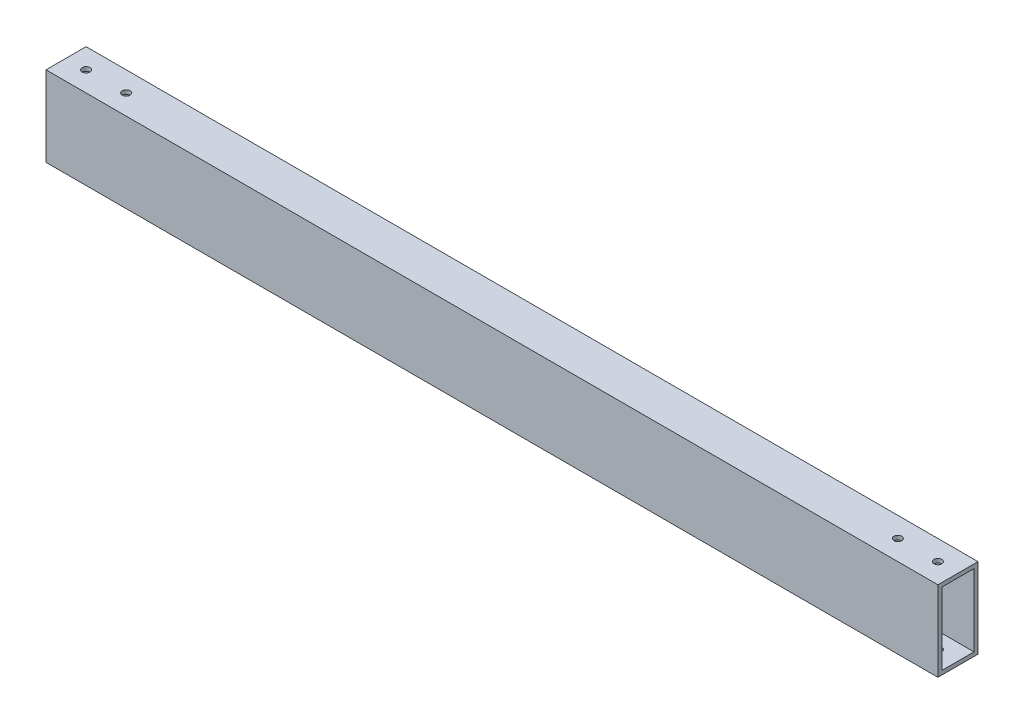
ISO-10303-21;
HEADER;
FILE_DESCRIPTION(('STEP AP214'),'2;1');
FILE_NAME('part.step','',(''),(''),'','','');
FILE_SCHEMA(('AUTOMOTIVE_DESIGN { 1 0 10303 214 1 1 1 1 }'));
ENDSEC;
DATA;
#1=APPLICATION_CONTEXT('core data for automotive mechanical design processes');
#2=APPLICATION_PROTOCOL_DEFINITION('international standard','automotive_design',2000,#1);
#3=PRODUCT_CONTEXT('',#1,'mechanical');
#4=PRODUCT('Part','Part','',(#3));
#5=PRODUCT_RELATED_PRODUCT_CATEGORY('part','',(#4));
#6=PRODUCT_DEFINITION_FORMATION('','',#4);
#7=PRODUCT_DEFINITION_CONTEXT('part definition',#1,'design');
#8=PRODUCT_DEFINITION('design','',#6,#7);
#9=PRODUCT_DEFINITION_SHAPE('','',#8);
#10=(LENGTH_UNIT() NAMED_UNIT(*) SI_UNIT(.MILLI.,.METRE.));
#11=(NAMED_UNIT(*) PLANE_ANGLE_UNIT() SI_UNIT($,.RADIAN.));
#12=(NAMED_UNIT(*) SI_UNIT($,.STERADIAN.) SOLID_ANGLE_UNIT());
#13=UNCERTAINTY_MEASURE_WITH_UNIT(LENGTH_MEASURE(1.E-05),#10,'distance_accuracy_value','');
#14=(GEOMETRIC_REPRESENTATION_CONTEXT(3) GLOBAL_UNCERTAINTY_ASSIGNED_CONTEXT((#13)) GLOBAL_UNIT_ASSIGNED_CONTEXT((#10,
#11,#12)) REPRESENTATION_CONTEXT('',''));
#15=CARTESIAN_POINT('',(0.,0.,0.));
#16=DIRECTION('',(0.,0.,1.));
#17=DIRECTION('',(1.,0.,0.));
#18=AXIS2_PLACEMENT_3D('',#15,#16,#17);
#19=CARTESIAN_POINT('',(282.575,0.,0.));
#20=DIRECTION('',(1.,0.,0.));
#21=DIRECTION('',(0.,0.,-1.));
#22=AXIS2_PLACEMENT_3D('',#19,#20,#21);
#23=PLANE('',#22);
#24=DIRECTION('',(0.,1.,0.));
#25=VECTOR('',#24,1.);
#26=CARTESIAN_POINT('',(282.575,-25.4,-12.7));
#27=LINE('',#26,#25);
#28=CARTESIAN_POINT('',(282.575,-25.4,-12.7));
#29=VERTEX_POINT('',#28);
#30=CARTESIAN_POINT('',(282.575,25.4,-12.7));
#31=VERTEX_POINT('',#30);
#32=EDGE_CURVE('E162',#29,#31,#27,.T.);
#33=ORIENTED_EDGE('',*,*,#32,.T.);
#34=DIRECTION('',(0.,0.,1.));
#35=VECTOR('',#34,1.);
#36=CARTESIAN_POINT('',(282.575,25.4,12.7));
#37=LINE('',#36,#35);
#38=CARTESIAN_POINT('',(282.575,25.4,12.7));
#39=VERTEX_POINT('',#38);
#40=EDGE_CURVE('E165',#31,#39,#37,.T.);
#41=ORIENTED_EDGE('',*,*,#40,.T.);
#42=DIRECTION('',(0.,-1.,0.));
#43=VECTOR('',#42,1.);
#44=CARTESIAN_POINT('',(282.575,-25.4,12.7));
#45=LINE('',#44,#43);
#46=CARTESIAN_POINT('',(282.575,-25.4,12.7));
#47=VERTEX_POINT('',#46);
#48=EDGE_CURVE('E168',#39,#47,#45,.T.);
#49=ORIENTED_EDGE('',*,*,#48,.T.);
#50=DIRECTION('',(0.,0.,-1.));
#51=VECTOR('',#50,1.);
#52=CARTESIAN_POINT('',(282.575,-25.4,12.7));
#53=LINE('',#52,#51);
#54=EDGE_CURVE('E170',#47,#29,#53,.T.);
#55=ORIENTED_EDGE('',*,*,#54,.T.);
#56=EDGE_LOOP('',(#33,#41,#49,#55));
#57=FACE_BOUND('',#56,.T.);
#58=DIRECTION('',(0.,0.,1.));
#59=VECTOR('',#58,1.);
#60=CARTESIAN_POINT('',(282.575,22.86,0.));
#61=LINE('',#60,#59);
#62=CARTESIAN_POINT('',(282.575,22.86,-10.16));
#63=VERTEX_POINT('',#62);
#64=CARTESIAN_POINT('',(282.575,22.86,10.16));
#65=VERTEX_POINT('',#64);
#66=EDGE_CURVE('E132',#63,#65,#61,.T.);
#67=ORIENTED_EDGE('',*,*,#66,.F.);
#68=DIRECTION('',(0.,1.,0.));
#69=VECTOR('',#68,1.);
#70=CARTESIAN_POINT('',(282.575,0.,-10.16));
#71=LINE('',#70,#69);
#72=CARTESIAN_POINT('',(282.575,-22.86,-10.16));
#73=VERTEX_POINT('',#72);
#74=EDGE_CURVE('E124',#73,#63,#71,.T.);
#75=ORIENTED_EDGE('',*,*,#74,.F.);
#76=DIRECTION('',(0.,0.,-1.));
#77=VECTOR('',#76,1.);
#78=CARTESIAN_POINT('',(282.575,-22.86,0.));
#79=LINE('',#78,#77);
#80=CARTESIAN_POINT('',(282.575,-22.86,10.16));
#81=VERTEX_POINT('',#80);
#82=EDGE_CURVE('E146',#81,#73,#79,.T.);
#83=ORIENTED_EDGE('',*,*,#82,.F.);
#84=DIRECTION('',(0.,-1.,0.));
#85=VECTOR('',#84,1.);
#86=CARTESIAN_POINT('',(282.575,0.,10.16));
#87=LINE('',#86,#85);
#88=EDGE_CURVE('E144',#65,#81,#87,.T.);
#89=ORIENTED_EDGE('',*,*,#88,.F.);
#90=EDGE_LOOP('',(#67,#75,#83,#89));
#91=FACE_BOUND('',#90,.T.);
#92=ADVANCED_FACE('F57',(#57,#91),#23,.T.);
#93=CARTESIAN_POINT('',(-282.575,0.,0.));
#94=DIRECTION('',(1.,0.,0.));
#95=DIRECTION('',(0.,0.,-1.));
#96=AXIS2_PLACEMENT_3D('',#93,#94,#95);
#97=PLANE('',#96);
#98=DIRECTION('',(0.,1.,0.));
#99=VECTOR('',#98,1.);
#100=CARTESIAN_POINT('',(-282.575,-25.4,-12.7));
#101=LINE('',#100,#99);
#102=CARTESIAN_POINT('',(-282.575,-25.4,-12.7));
#103=VERTEX_POINT('',#102);
#104=CARTESIAN_POINT('',(-282.575,25.4,-12.7));
#105=VERTEX_POINT('',#104);
#106=EDGE_CURVE('E140',#103,#105,#101,.T.);
#107=ORIENTED_EDGE('',*,*,#106,.F.);
#108=DIRECTION('',(0.,0.,-1.));
#109=VECTOR('',#108,1.);
#110=CARTESIAN_POINT('',(-282.575,-25.4,12.7));
#111=LINE('',#110,#109);
#112=CARTESIAN_POINT('',(-282.575,-25.4,12.7));
#113=VERTEX_POINT('',#112);
#114=EDGE_CURVE('E166',#113,#103,#111,.T.);
#115=ORIENTED_EDGE('',*,*,#114,.F.);
#116=DIRECTION('',(0.,-1.,0.));
#117=VECTOR('',#116,1.);
#118=CARTESIAN_POINT('',(-282.575,-25.4,12.7));
#119=LINE('',#118,#117);
#120=CARTESIAN_POINT('',(-282.575,25.4,12.7));
#121=VERTEX_POINT('',#120);
#122=EDGE_CURVE('E177',#121,#113,#119,.T.);
#123=ORIENTED_EDGE('',*,*,#122,.F.);
#124=DIRECTION('',(0.,0.,1.));
#125=VECTOR('',#124,1.);
#126=CARTESIAN_POINT('',(-282.575,25.4,12.7));
#127=LINE('',#126,#125);
#128=EDGE_CURVE('E175',#105,#121,#127,.T.);
#129=ORIENTED_EDGE('',*,*,#128,.F.);
#130=EDGE_LOOP('',(#107,#115,#123,#129));
#131=FACE_BOUND('',#130,.T.);
#132=DIRECTION('',(0.,1.,0.));
#133=VECTOR('',#132,1.);
#134=CARTESIAN_POINT('',(-282.575,0.,-10.16));
#135=LINE('',#134,#133);
#136=CARTESIAN_POINT('',(-282.575,-22.86,-10.16));
#137=VERTEX_POINT('',#136);
#138=CARTESIAN_POINT('',(-282.575,22.86,-10.16));
#139=VERTEX_POINT('',#138);
#140=EDGE_CURVE('E82',#137,#139,#135,.T.);
#141=ORIENTED_EDGE('',*,*,#140,.T.);
#142=DIRECTION('',(0.,0.,1.));
#143=VECTOR('',#142,1.);
#144=CARTESIAN_POINT('',(-282.575,22.86,0.));
#145=LINE('',#144,#143);
#146=CARTESIAN_POINT('',(-282.575,22.86,10.16));
#147=VERTEX_POINT('',#146);
#148=EDGE_CURVE('E139',#139,#147,#145,.T.);
#149=ORIENTED_EDGE('',*,*,#148,.T.);
#150=DIRECTION('',(0.,-1.,0.));
#151=VECTOR('',#150,1.);
#152=CARTESIAN_POINT('',(-282.575,0.,10.16));
#153=LINE('',#152,#151);
#154=CARTESIAN_POINT('',(-282.575,-22.86,10.16));
#155=VERTEX_POINT('',#154);
#156=EDGE_CURVE('E154',#147,#155,#153,.T.);
#157=ORIENTED_EDGE('',*,*,#156,.T.);
#158=DIRECTION('',(0.,0.,-1.));
#159=VECTOR('',#158,1.);
#160=CARTESIAN_POINT('',(-282.575,-22.86,0.));
#161=LINE('',#160,#159);
#162=EDGE_CURVE('E133',#155,#137,#161,.T.);
#163=ORIENTED_EDGE('',*,*,#162,.T.);
#164=EDGE_LOOP('',(#141,#149,#157,#163));
#165=FACE_BOUND('',#164,.T.);
#166=ADVANCED_FACE('F229',(#131,#165),#97,.F.);
#167=CARTESIAN_POINT('',(282.575,-25.4,-12.7));
#168=DIRECTION('',(0.,0.,1.));
#169=DIRECTION('',(1.,0.,0.));
#170=AXIS2_PLACEMENT_3D('',#167,#168,#169);
#171=PLANE('',#170);
#172=ORIENTED_EDGE('',*,*,#106,.T.);
#173=DIRECTION('',(-1.,0.,0.));
#174=VECTOR('',#173,1.);
#175=CARTESIAN_POINT('',(282.575,25.4,-12.7));
#176=LINE('',#175,#174);
#177=EDGE_CURVE('E12',#31,#105,#176,.T.);
#178=ORIENTED_EDGE('',*,*,#177,.F.);
#179=ORIENTED_EDGE('',*,*,#32,.F.);
#180=DIRECTION('',(-1.,0.,0.));
#181=VECTOR('',#180,1.);
#182=CARTESIAN_POINT('',(282.575,-25.4,-12.7));
#183=LINE('',#182,#181);
#184=EDGE_CURVE('E172',#29,#103,#183,.T.);
#185=ORIENTED_EDGE('',*,*,#184,.T.);
#186=EDGE_LOOP('',(#172,#178,#179,#185));
#187=FACE_BOUND('',#186,.T.);
#188=ADVANCED_FACE('F59',(#187),#171,.F.);
#189=CARTESIAN_POINT('',(282.575,25.4,12.7));
#190=DIRECTION('',(0.,-1.,0.));
#191=DIRECTION('',(0.,0.,-1.));
#192=AXIS2_PLACEMENT_3D('',#189,#190,#191);
#193=PLANE('',#192);
#194=CARTESIAN_POINT('',(-269.875,25.4,0.));
#195=DIRECTION('',(0.,1.,0.));
#196=DIRECTION('',(0.,0.,1.));
#197=AXIS2_PLACEMENT_3D('',#194,#195,#196);
#198=CIRCLE('',#197,2.47650000000003);
#199=CARTESIAN_POINT('',(-269.875,25.4,2.47650000000006));
#200=VERTEX_POINT('',#199);
#201=EDGE_CURVE('E265',#200,#200,#198,.T.);
#202=ORIENTED_EDGE('',*,*,#201,.F.);
#203=EDGE_LOOP('',(#202));
#204=FACE_BOUND('',#203,.T.);
#205=CARTESIAN_POINT('',(244.475,25.4,2.08166817117217E-13));
#206=DIRECTION('',(0.,1.,0.));
#207=DIRECTION('',(0.,0.,1.));
#208=AXIS2_PLACEMENT_3D('',#205,#206,#207);
#209=CIRCLE('',#208,2.47649999999997);
#210=CARTESIAN_POINT('',(244.475,25.4,2.47650000000018));
#211=VERTEX_POINT('',#210);
#212=EDGE_CURVE('E269',#211,#211,#209,.T.);
#213=ORIENTED_EDGE('',*,*,#212,.F.);
#214=EDGE_LOOP('',(#213));
#215=FACE_BOUND('',#214,.T.);
#216=CARTESIAN_POINT('',(269.875,25.4,2.08166817117217E-13));
#217=DIRECTION('',(0.,1.,0.));
#218=DIRECTION('',(0.,0.,1.));
#219=AXIS2_PLACEMENT_3D('',#216,#217,#218);
#220=CIRCLE('',#219,2.47650000000003);
#221=CARTESIAN_POINT('',(269.875,25.4,2.47650000000024));
#222=VERTEX_POINT('',#221);
#223=EDGE_CURVE('E273',#222,#222,#220,.T.);
#224=ORIENTED_EDGE('',*,*,#223,.F.);
#225=EDGE_LOOP('',(#224));
#226=FACE_BOUND('',#225,.T.);
#227=CARTESIAN_POINT('',(-244.475,25.4,0.));
#228=DIRECTION('',(0.,1.,0.));
#229=DIRECTION('',(0.,0.,1.));
#230=AXIS2_PLACEMENT_3D('',#227,#228,#229);
#231=CIRCLE('',#230,2.4765);
#232=CARTESIAN_POINT('',(-244.475,25.4,2.47650000000003));
#233=VERTEX_POINT('',#232);
#234=EDGE_CURVE('E277',#233,#233,#231,.T.);
#235=ORIENTED_EDGE('',*,*,#234,.F.);
#236=EDGE_LOOP('',(#235));
#237=FACE_BOUND('',#236,.T.);
#238=ORIENTED_EDGE('',*,*,#128,.T.);
#239=DIRECTION('',(-1.,0.,0.));
#240=VECTOR('',#239,1.);
#241=CARTESIAN_POINT('',(282.575,25.4,12.7));
#242=LINE('',#241,#240);
#243=EDGE_CURVE('E66',#39,#121,#242,.T.);
#244=ORIENTED_EDGE('',*,*,#243,.F.);
#245=ORIENTED_EDGE('',*,*,#40,.F.);
#246=ORIENTED_EDGE('',*,*,#177,.T.);
#247=EDGE_LOOP('',(#238,#244,#245,#246));
#248=FACE_BOUND('',#247,.T.);
#249=ADVANCED_FACE('F254',(#204,#215,#226,#237,#248),#193,.F.);
#250=CARTESIAN_POINT('',(282.575,-25.4,12.7));
#251=DIRECTION('',(0.,0.,-1.));
#252=DIRECTION('',(-1.,0.,0.));
#253=AXIS2_PLACEMENT_3D('',#250,#251,#252);
#254=PLANE('',#253);
#255=ORIENTED_EDGE('',*,*,#122,.T.);
#256=DIRECTION('',(-1.,0.,0.));
#257=VECTOR('',#256,1.);
#258=CARTESIAN_POINT('',(282.575,-25.4,12.7));
#259=LINE('',#258,#257);
#260=EDGE_CURVE('E182',#47,#113,#259,.T.);
#261=ORIENTED_EDGE('',*,*,#260,.F.);
#262=ORIENTED_EDGE('',*,*,#48,.F.);
#263=ORIENTED_EDGE('',*,*,#243,.T.);
#264=EDGE_LOOP('',(#255,#261,#262,#263));
#265=FACE_BOUND('',#264,.T.);
#266=ADVANCED_FACE('F251',(#265),#254,.F.);
#267=CARTESIAN_POINT('',(282.575,-25.4,12.7));
#268=DIRECTION('',(0.,1.,0.));
#269=DIRECTION('',(0.,0.,1.));
#270=AXIS2_PLACEMENT_3D('',#267,#268,#269);
#271=PLANE('',#270);
#272=CARTESIAN_POINT('',(-269.875,-25.4,0.));
#273=DIRECTION('',(0.,1.,0.));
#274=DIRECTION('',(0.,0.,1.));
#275=AXIS2_PLACEMENT_3D('',#272,#273,#274);
#276=CIRCLE('',#275,2.47650000000003);
#277=CARTESIAN_POINT('',(-269.875,-25.4,2.47650000000006));
#278=VERTEX_POINT('',#277);
#279=EDGE_CURVE('E191',#278,#278,#276,.T.);
#280=ORIENTED_EDGE('',*,*,#279,.T.);
#281=EDGE_LOOP('',(#280));
#282=FACE_BOUND('',#281,.T.);
#283=CARTESIAN_POINT('',(244.475,-25.4,2.08166817117217E-13));
#284=DIRECTION('',(0.,1.,0.));
#285=DIRECTION('',(0.,0.,1.));
#286=AXIS2_PLACEMENT_3D('',#283,#284,#285);
#287=CIRCLE('',#286,2.47649999999997);
#288=CARTESIAN_POINT('',(244.475,-25.4,2.47650000000018));
#289=VERTEX_POINT('',#288);
#290=EDGE_CURVE('E298',#289,#289,#287,.T.);
#291=ORIENTED_EDGE('',*,*,#290,.T.);
#292=EDGE_LOOP('',(#291));
#293=FACE_BOUND('',#292,.T.);
#294=CARTESIAN_POINT('',(269.875,-25.4,2.08166817117217E-13));
#295=DIRECTION('',(0.,1.,0.));
#296=DIRECTION('',(0.,0.,1.));
#297=AXIS2_PLACEMENT_3D('',#294,#295,#296);
#298=CIRCLE('',#297,2.47650000000003);
#299=CARTESIAN_POINT('',(269.875,-25.4,2.47650000000024));
#300=VERTEX_POINT('',#299);
#301=EDGE_CURVE('E291',#300,#300,#298,.T.);
#302=ORIENTED_EDGE('',*,*,#301,.T.);
#303=EDGE_LOOP('',(#302));
#304=FACE_BOUND('',#303,.T.);
#305=CARTESIAN_POINT('',(-244.475,-25.4,0.));
#306=DIRECTION('',(0.,1.,0.));
#307=DIRECTION('',(0.,0.,1.));
#308=AXIS2_PLACEMENT_3D('',#305,#306,#307);
#309=CIRCLE('',#308,2.4765);
#310=CARTESIAN_POINT('',(-244.475,-25.4,2.47650000000003));
#311=VERTEX_POINT('',#310);
#312=EDGE_CURVE('E290',#311,#311,#309,.T.);
#313=ORIENTED_EDGE('',*,*,#312,.T.);
#314=EDGE_LOOP('',(#313));
#315=FACE_BOUND('',#314,.T.);
#316=ORIENTED_EDGE('',*,*,#114,.T.);
#317=ORIENTED_EDGE('',*,*,#184,.F.);
#318=ORIENTED_EDGE('',*,*,#54,.F.);
#319=ORIENTED_EDGE('',*,*,#260,.T.);
#320=EDGE_LOOP('',(#316,#317,#318,#319));
#321=FACE_BOUND('',#320,.T.);
#322=ADVANCED_FACE('F248',(#282,#293,#304,#315,#321),#271,.F.);
#323=CARTESIAN_POINT('',(282.575,0.,-10.16));
#324=DIRECTION('',(0.,0.,1.));
#325=DIRECTION('',(1.,0.,0.));
#326=AXIS2_PLACEMENT_3D('',#323,#324,#325);
#327=PLANE('',#326);
#328=ORIENTED_EDGE('',*,*,#140,.F.);
#329=DIRECTION('',(-1.,0.,0.));
#330=VECTOR('',#329,1.);
#331=CARTESIAN_POINT('',(282.575,-22.86,-10.16));
#332=LINE('',#331,#330);
#333=EDGE_CURVE('E128',#73,#137,#332,.T.);
#334=ORIENTED_EDGE('',*,*,#333,.F.);
#335=ORIENTED_EDGE('',*,*,#74,.T.);
#336=DIRECTION('',(-1.,0.,0.));
#337=VECTOR('',#336,1.);
#338=CARTESIAN_POINT('',(282.575,22.86,-10.16));
#339=LINE('',#338,#337);
#340=EDGE_CURVE('E127',#63,#139,#339,.T.);
#341=ORIENTED_EDGE('',*,*,#340,.T.);
#342=EDGE_LOOP('',(#328,#334,#335,#341));
#343=FACE_BOUND('',#342,.T.);
#344=ADVANCED_FACE('F126',(#343),#327,.T.);
#345=CARTESIAN_POINT('',(282.575,22.86,0.));
#346=DIRECTION('',(0.,-1.,0.));
#347=DIRECTION('',(0.,0.,-1.));
#348=AXIS2_PLACEMENT_3D('',#345,#346,#347);
#349=PLANE('',#348);
#350=CARTESIAN_POINT('',(-269.875,22.86,0.));
#351=DIRECTION('',(0.,-1.,0.));
#352=DIRECTION('',(0.,0.,-1.));
#353=AXIS2_PLACEMENT_3D('',#350,#351,#352);
#354=CIRCLE('',#353,2.47650000000003);
#355=CARTESIAN_POINT('',(-269.875,22.86,-2.47650000000001));
#356=VERTEX_POINT('',#355);
#357=EDGE_CURVE('E152',#356,#356,#354,.T.);
#358=ORIENTED_EDGE('',*,*,#357,.F.);
#359=EDGE_LOOP('',(#358));
#360=FACE_BOUND('',#359,.T.);
#361=CARTESIAN_POINT('',(244.475,22.86,2.08166817117217E-13));
#362=DIRECTION('',(0.,-1.,0.));
#363=DIRECTION('',(0.,0.,-1.));
#364=AXIS2_PLACEMENT_3D('',#361,#362,#363);
#365=CIRCLE('',#364,2.47649999999997);
#366=CARTESIAN_POINT('',(244.475,22.86,-2.47649999999976));
#367=VERTEX_POINT('',#366);
#368=EDGE_CURVE('E197',#367,#367,#365,.T.);
#369=ORIENTED_EDGE('',*,*,#368,.F.);
#370=EDGE_LOOP('',(#369));
#371=FACE_BOUND('',#370,.T.);
#372=CARTESIAN_POINT('',(269.875,22.86,2.08166817117217E-13));
#373=DIRECTION('',(0.,-1.,0.));
#374=DIRECTION('',(0.,0.,-1.));
#375=AXIS2_PLACEMENT_3D('',#372,#373,#374);
#376=CIRCLE('',#375,2.47650000000003);
#377=CARTESIAN_POINT('',(269.875,22.86,-2.47649999999982));
#378=VERTEX_POINT('',#377);
#379=EDGE_CURVE('E194',#378,#378,#376,.T.);
#380=ORIENTED_EDGE('',*,*,#379,.F.);
#381=EDGE_LOOP('',(#380));
#382=FACE_BOUND('',#381,.T.);
#383=CARTESIAN_POINT('',(-244.475,22.86,0.));
#384=DIRECTION('',(0.,-1.,0.));
#385=DIRECTION('',(0.,0.,-1.));
#386=AXIS2_PLACEMENT_3D('',#383,#384,#385);
#387=CIRCLE('',#386,2.4765);
#388=CARTESIAN_POINT('',(-244.475,22.86,-2.47649999999997));
#389=VERTEX_POINT('',#388);
#390=EDGE_CURVE('E190',#389,#389,#387,.T.);
#391=ORIENTED_EDGE('',*,*,#390,.F.);
#392=EDGE_LOOP('',(#391));
#393=FACE_BOUND('',#392,.T.);
#394=ORIENTED_EDGE('',*,*,#148,.F.);
#395=ORIENTED_EDGE('',*,*,#340,.F.);
#396=ORIENTED_EDGE('',*,*,#66,.T.);
#397=DIRECTION('',(-1.,0.,0.));
#398=VECTOR('',#397,1.);
#399=CARTESIAN_POINT('',(282.575,22.86,10.16));
#400=LINE('',#399,#398);
#401=EDGE_CURVE('E141',#65,#147,#400,.T.);
#402=ORIENTED_EDGE('',*,*,#401,.T.);
#403=EDGE_LOOP('',(#394,#395,#396,#402));
#404=FACE_BOUND('',#403,.T.);
#405=ADVANCED_FACE('F136',(#360,#371,#382,#393,#404),#349,.T.);
#406=CARTESIAN_POINT('',(282.575,0.,10.16));
#407=DIRECTION('',(0.,0.,-1.));
#408=DIRECTION('',(-1.,0.,0.));
#409=AXIS2_PLACEMENT_3D('',#406,#407,#408);
#410=PLANE('',#409);
#411=ORIENTED_EDGE('',*,*,#156,.F.);
#412=ORIENTED_EDGE('',*,*,#401,.F.);
#413=ORIENTED_EDGE('',*,*,#88,.T.);
#414=DIRECTION('',(-1.,0.,0.));
#415=VECTOR('',#414,1.);
#416=CARTESIAN_POINT('',(282.575,-22.86,10.16));
#417=LINE('',#416,#415);
#418=EDGE_CURVE('E74',#81,#155,#417,.T.);
#419=ORIENTED_EDGE('',*,*,#418,.T.);
#420=EDGE_LOOP('',(#411,#412,#413,#419));
#421=FACE_BOUND('',#420,.T.);
#422=ADVANCED_FACE('F221',(#421),#410,.T.);
#423=CARTESIAN_POINT('',(282.575,-22.86,0.));
#424=DIRECTION('',(0.,1.,0.));
#425=DIRECTION('',(0.,0.,1.));
#426=AXIS2_PLACEMENT_3D('',#423,#424,#425);
#427=PLANE('',#426);
#428=CARTESIAN_POINT('',(-269.875,-22.86,0.));
#429=DIRECTION('',(0.,1.,0.));
#430=DIRECTION('',(0.,0.,1.));
#431=AXIS2_PLACEMENT_3D('',#428,#429,#430);
#432=CIRCLE('',#431,2.47650000000003);
#433=CARTESIAN_POINT('',(-269.875,-22.86,2.47650000000006));
#434=VERTEX_POINT('',#433);
#435=EDGE_CURVE('E61',#434,#434,#432,.T.);
#436=ORIENTED_EDGE('',*,*,#435,.F.);
#437=EDGE_LOOP('',(#436));
#438=FACE_BOUND('',#437,.T.);
#439=CARTESIAN_POINT('',(244.475,-22.86,2.08166817117217E-13));
#440=DIRECTION('',(0.,1.,0.));
#441=DIRECTION('',(0.,0.,1.));
#442=AXIS2_PLACEMENT_3D('',#439,#440,#441);
#443=CIRCLE('',#442,2.47649999999997);
#444=CARTESIAN_POINT('',(244.475,-22.86,2.47650000000018));
#445=VERTEX_POINT('',#444);
#446=EDGE_CURVE('E195',#445,#445,#443,.T.);
#447=ORIENTED_EDGE('',*,*,#446,.F.);
#448=EDGE_LOOP('',(#447));
#449=FACE_BOUND('',#448,.T.);
#450=CARTESIAN_POINT('',(269.875,-22.86,2.08166817117217E-13));
#451=DIRECTION('',(0.,1.,0.));
#452=DIRECTION('',(0.,0.,1.));
#453=AXIS2_PLACEMENT_3D('',#450,#451,#452);
#454=CIRCLE('',#453,2.47650000000003);
#455=CARTESIAN_POINT('',(269.875,-22.86,2.47650000000024));
#456=VERTEX_POINT('',#455);
#457=EDGE_CURVE('E192',#456,#456,#454,.T.);
#458=ORIENTED_EDGE('',*,*,#457,.F.);
#459=EDGE_LOOP('',(#458));
#460=FACE_BOUND('',#459,.T.);
#461=CARTESIAN_POINT('',(-244.475,-22.86,0.));
#462=DIRECTION('',(0.,1.,0.));
#463=DIRECTION('',(0.,0.,1.));
#464=AXIS2_PLACEMENT_3D('',#461,#462,#463);
#465=CIRCLE('',#464,2.4765);
#466=CARTESIAN_POINT('',(-244.475,-22.86,2.47650000000003));
#467=VERTEX_POINT('',#466);
#468=EDGE_CURVE('E187',#467,#467,#465,.T.);
#469=ORIENTED_EDGE('',*,*,#468,.F.);
#470=EDGE_LOOP('',(#469));
#471=FACE_BOUND('',#470,.T.);
#472=ORIENTED_EDGE('',*,*,#162,.F.);
#473=ORIENTED_EDGE('',*,*,#418,.F.);
#474=ORIENTED_EDGE('',*,*,#82,.T.);
#475=ORIENTED_EDGE('',*,*,#333,.T.);
#476=EDGE_LOOP('',(#472,#473,#474,#475));
#477=FACE_BOUND('',#476,.T.);
#478=ADVANCED_FACE('F217',(#438,#449,#460,#471,#477),#427,.T.);
#479=CARTESIAN_POINT('',(-244.475,-25.4,0.));
#480=DIRECTION('',(0.,1.,0.));
#481=DIRECTION('',(0.,0.,1.));
#482=AXIS2_PLACEMENT_3D('',#479,#480,#481);
#483=CYLINDRICAL_SURFACE('',#482,2.4765);
#484=ORIENTED_EDGE('',*,*,#468,.T.);
#485=EDGE_LOOP('',(#484));
#486=FACE_BOUND('',#485,.T.);
#487=ORIENTED_EDGE('',*,*,#312,.F.);
#488=EDGE_LOOP('',(#487));
#489=FACE_BOUND('',#488,.T.);
#490=ADVANCED_FACE('F220',(#486,#489),#483,.F.);
#491=CARTESIAN_POINT('',(269.875,-25.4,2.08166817117217E-13));
#492=DIRECTION('',(0.,1.,0.));
#493=DIRECTION('',(0.,0.,1.));
#494=AXIS2_PLACEMENT_3D('',#491,#492,#493);
#495=CYLINDRICAL_SURFACE('',#494,2.47650000000003);
#496=ORIENTED_EDGE('',*,*,#457,.T.);
#497=EDGE_LOOP('',(#496));
#498=FACE_BOUND('',#497,.T.);
#499=ORIENTED_EDGE('',*,*,#301,.F.);
#500=EDGE_LOOP('',(#499));
#501=FACE_BOUND('',#500,.T.);
#502=ADVANCED_FACE('F320',(#498,#501),#495,.F.);
#503=CARTESIAN_POINT('',(244.475,-25.4,2.08166817117217E-13));
#504=DIRECTION('',(0.,1.,0.));
#505=DIRECTION('',(0.,0.,1.));
#506=AXIS2_PLACEMENT_3D('',#503,#504,#505);
#507=CYLINDRICAL_SURFACE('',#506,2.47649999999997);
#508=ORIENTED_EDGE('',*,*,#446,.T.);
#509=EDGE_LOOP('',(#508));
#510=FACE_BOUND('',#509,.T.);
#511=ORIENTED_EDGE('',*,*,#290,.F.);
#512=EDGE_LOOP('',(#511));
#513=FACE_BOUND('',#512,.T.);
#514=ADVANCED_FACE('F310',(#510,#513),#507,.F.);
#515=CARTESIAN_POINT('',(-269.875,-25.4,0.));
#516=DIRECTION('',(0.,1.,0.));
#517=DIRECTION('',(0.,0.,1.));
#518=AXIS2_PLACEMENT_3D('',#515,#516,#517);
#519=CYLINDRICAL_SURFACE('',#518,2.47650000000003);
#520=ORIENTED_EDGE('',*,*,#435,.T.);
#521=EDGE_LOOP('',(#520));
#522=FACE_BOUND('',#521,.T.);
#523=ORIENTED_EDGE('',*,*,#279,.F.);
#524=EDGE_LOOP('',(#523));
#525=FACE_BOUND('',#524,.T.);
#526=ADVANCED_FACE('F214',(#522,#525),#519,.F.);
#527=ORIENTED_EDGE('',*,*,#390,.T.);
#528=EDGE_LOOP('',(#527));
#529=FACE_BOUND('',#528,.T.);
#530=ORIENTED_EDGE('',*,*,#234,.T.);
#531=EDGE_LOOP('',(#530));
#532=FACE_BOUND('',#531,.T.);
#533=ADVANCED_FACE('F309',(#529,#532),#483,.F.);
#534=ORIENTED_EDGE('',*,*,#379,.T.);
#535=EDGE_LOOP('',(#534));
#536=FACE_BOUND('',#535,.T.);
#537=ORIENTED_EDGE('',*,*,#223,.T.);
#538=EDGE_LOOP('',(#537));
#539=FACE_BOUND('',#538,.T.);
#540=ADVANCED_FACE('F317',(#536,#539),#495,.F.);
#541=ORIENTED_EDGE('',*,*,#368,.T.);
#542=EDGE_LOOP('',(#541));
#543=FACE_BOUND('',#542,.T.);
#544=ORIENTED_EDGE('',*,*,#212,.T.);
#545=EDGE_LOOP('',(#544));
#546=FACE_BOUND('',#545,.T.);
#547=ADVANCED_FACE('F322',(#543,#546),#507,.F.);
#548=ORIENTED_EDGE('',*,*,#357,.T.);
#549=EDGE_LOOP('',(#548));
#550=FACE_BOUND('',#549,.T.);
#551=ORIENTED_EDGE('',*,*,#201,.T.);
#552=EDGE_LOOP('',(#551));
#553=FACE_BOUND('',#552,.T.);
#554=ADVANCED_FACE('F312',(#550,#553),#519,.F.);
#555=CLOSED_SHELL('',(#92,#166,#188,#249,#266,#322,#344,#405,#422,#478,#490,#502,#514,#526,#533,
#540,#547,#554));
#556=MANIFOLD_SOLID_BREP('B2',#555);
#557=ADVANCED_BREP_SHAPE_REPRESENTATION('',(#18,#556),#14);
#558=SHAPE_DEFINITION_REPRESENTATION(#9,#557);
ENDSEC;
END-ISO-10303-21;
